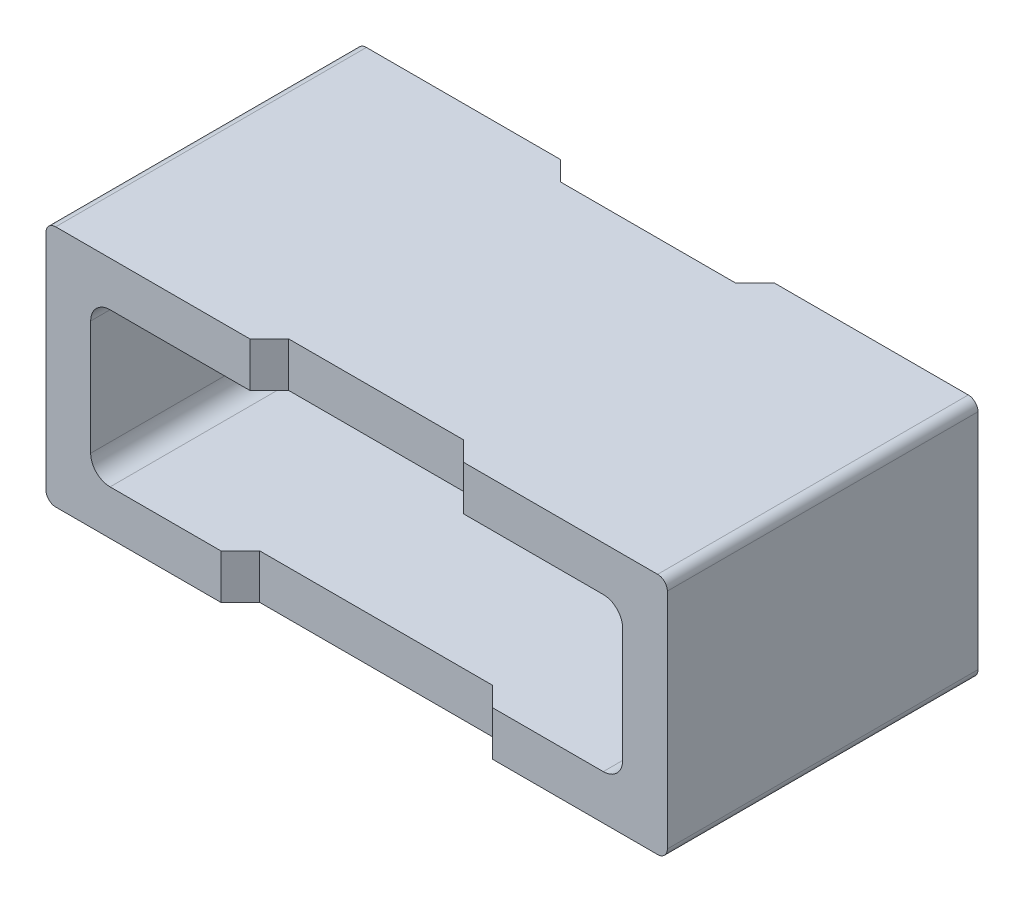
ISO-10303-21;
HEADER;
FILE_DESCRIPTION(('STEP AP214'),'2;1');
FILE_NAME('part.step','',(''),(''),'','','');
FILE_SCHEMA(('AUTOMOTIVE_DESIGN { 1 0 10303 214 1 1 1 1 }'));
ENDSEC;
DATA;
#1=APPLICATION_CONTEXT('core data for automotive mechanical design processes');
#2=APPLICATION_PROTOCOL_DEFINITION('international standard','automotive_design',2000,#1);
#3=PRODUCT_CONTEXT('',#1,'mechanical');
#4=PRODUCT('Part','Part','',(#3));
#5=PRODUCT_RELATED_PRODUCT_CATEGORY('part','',(#4));
#6=PRODUCT_DEFINITION_FORMATION('','',#4);
#7=PRODUCT_DEFINITION_CONTEXT('part definition',#1,'design');
#8=PRODUCT_DEFINITION('design','',#6,#7);
#9=PRODUCT_DEFINITION_SHAPE('','',#8);
#10=(LENGTH_UNIT() NAMED_UNIT(*) SI_UNIT(.MILLI.,.METRE.));
#11=(NAMED_UNIT(*) PLANE_ANGLE_UNIT() SI_UNIT($,.RADIAN.));
#12=(NAMED_UNIT(*) SI_UNIT($,.STERADIAN.) SOLID_ANGLE_UNIT());
#13=UNCERTAINTY_MEASURE_WITH_UNIT(LENGTH_MEASURE(1.E-05),#10,'distance_accuracy_value','');
#14=(GEOMETRIC_REPRESENTATION_CONTEXT(3) GLOBAL_UNCERTAINTY_ASSIGNED_CONTEXT((#13)) GLOBAL_UNIT_ASSIGNED_CONTEXT((#10,
#11,#12)) REPRESENTATION_CONTEXT('',''));
#15=CARTESIAN_POINT('',(0.,0.,0.));
#16=DIRECTION('',(0.,0.,1.));
#17=DIRECTION('',(1.,0.,0.));
#18=AXIS2_PLACEMENT_3D('',#15,#16,#17);
#19=CARTESIAN_POINT('',(-1.27,-0.295,0.));
#20=DIRECTION('',(0.,0.,1.));
#21=DIRECTION('',(1.,0.,0.));
#22=AXIS2_PLACEMENT_3D('',#19,#20,#21);
#23=CYLINDRICAL_SURFACE('',#22,0.1);
#24=CARTESIAN_POINT('',(-1.27,-0.295,-1.6));
#25=DIRECTION('',(0.,0.,1.));
#26=DIRECTION('',(1.,0.,0.));
#27=AXIS2_PLACEMENT_3D('',#24,#25,#26);
#28=CIRCLE('',#27,0.1);
#29=CARTESIAN_POINT('',(-1.37,-0.295,-1.6));
#30=VERTEX_POINT('',#29);
#31=CARTESIAN_POINT('',(-1.27,-0.395,-1.6));
#32=VERTEX_POINT('',#31);
#33=EDGE_CURVE('E230',#30,#32,#28,.T.);
#34=ORIENTED_EDGE('',*,*,#33,.F.);
#35=DIRECTION('',(0.,0.,-1.));
#36=VECTOR('',#35,1.);
#37=CARTESIAN_POINT('',(-1.37,-0.295,0.));
#38=LINE('',#37,#36);
#39=CARTESIAN_POINT('',(-1.37,-0.295,0.));
#40=VERTEX_POINT('',#39);
#41=EDGE_CURVE('E228',#40,#30,#38,.T.);
#42=ORIENTED_EDGE('',*,*,#41,.F.);
#43=CARTESIAN_POINT('',(-1.27,-0.295,0.));
#44=DIRECTION('',(0.,0.,1.));
#45=DIRECTION('',(1.,0.,0.));
#46=AXIS2_PLACEMENT_3D('',#43,#44,#45);
#47=CIRCLE('',#46,0.1);
#48=CARTESIAN_POINT('',(-1.27,-0.395,0.));
#49=VERTEX_POINT('',#48);
#50=EDGE_CURVE('E20',#49,#40,#47,.F.);
#51=ORIENTED_EDGE('',*,*,#50,.F.);
#52=DIRECTION('',(0.,0.,1.));
#53=VECTOR('',#52,1.);
#54=CARTESIAN_POINT('',(-1.27,-0.395,0.));
#55=LINE('',#54,#53);
#56=EDGE_CURVE('E225',#32,#49,#55,.T.);
#57=ORIENTED_EDGE('',*,*,#56,.F.);
#58=EDGE_LOOP('',(#34,#42,#51,#57));
#59=FACE_BOUND('',#58,.T.);
#60=ADVANCED_FACE('F17',(#59),#23,.F.);
#61=CARTESIAN_POINT('',(1.27,-0.295,0.));
#62=DIRECTION('',(0.,0.,1.));
#63=DIRECTION('',(1.,0.,0.));
#64=AXIS2_PLACEMENT_3D('',#61,#62,#63);
#65=CYLINDRICAL_SURFACE('',#64,0.1);
#66=CARTESIAN_POINT('',(1.27,-0.295,-1.6));
#67=DIRECTION('',(0.,0.,1.));
#68=DIRECTION('',(1.,0.,0.));
#69=AXIS2_PLACEMENT_3D('',#66,#67,#68);
#70=CIRCLE('',#69,0.1);
#71=CARTESIAN_POINT('',(1.27,-0.395,-1.6));
#72=VERTEX_POINT('',#71);
#73=CARTESIAN_POINT('',(1.37,-0.295,-1.6));
#74=VERTEX_POINT('',#73);
#75=EDGE_CURVE('E257',#72,#74,#70,.T.);
#76=ORIENTED_EDGE('',*,*,#75,.F.);
#77=DIRECTION('',(0.,0.,1.));
#78=VECTOR('',#77,1.);
#79=CARTESIAN_POINT('',(1.27,-0.395,0.));
#80=LINE('',#79,#78);
#81=CARTESIAN_POINT('',(1.27,-0.395,0.));
#82=VERTEX_POINT('',#81);
#83=EDGE_CURVE('E324',#82,#72,#80,.F.);
#84=ORIENTED_EDGE('',*,*,#83,.F.);
#85=CARTESIAN_POINT('',(1.27,-0.295,0.));
#86=DIRECTION('',(0.,0.,1.));
#87=DIRECTION('',(1.,0.,0.));
#88=AXIS2_PLACEMENT_3D('',#85,#86,#87);
#89=CIRCLE('',#88,0.1);
#90=CARTESIAN_POINT('',(1.37,-0.295,0.));
#91=VERTEX_POINT('',#90);
#92=EDGE_CURVE('E298',#91,#82,#89,.F.);
#93=ORIENTED_EDGE('',*,*,#92,.F.);
#94=DIRECTION('',(0.,0.,1.));
#95=VECTOR('',#94,1.);
#96=CARTESIAN_POINT('',(1.37,-0.295,0.));
#97=LINE('',#96,#95);
#98=EDGE_CURVE('E251',#74,#91,#97,.T.);
#99=ORIENTED_EDGE('',*,*,#98,.F.);
#100=EDGE_LOOP('',(#76,#84,#93,#99));
#101=FACE_BOUND('',#100,.T.);
#102=ADVANCED_FACE('F372',(#101),#65,.F.);
#103=CARTESIAN_POINT('',(-1.37,-0.295,0.));
#104=DIRECTION('',(1.,0.,0.));
#105=DIRECTION('',(0.,0.,-1.));
#106=AXIS2_PLACEMENT_3D('',#103,#104,#105);
#107=PLANE('',#106);
#108=DIRECTION('',(0.,0.,1.));
#109=VECTOR('',#108,1.);
#110=CARTESIAN_POINT('',(-1.37,0.295,0.));
#111=LINE('',#110,#109);
#112=CARTESIAN_POINT('',(-1.37,0.295,-1.6));
#113=VERTEX_POINT('',#112);
#114=CARTESIAN_POINT('',(-1.37,0.295,0.));
#115=VERTEX_POINT('',#114);
#116=EDGE_CURVE('E291',#113,#115,#111,.T.);
#117=ORIENTED_EDGE('',*,*,#116,.T.);
#118=DIRECTION('',(0.,1.,0.));
#119=VECTOR('',#118,1.);
#120=CARTESIAN_POINT('',(-1.37,-0.295,0.));
#121=LINE('',#120,#119);
#122=EDGE_CURVE('E309',#115,#40,#121,.F.);
#123=ORIENTED_EDGE('',*,*,#122,.T.);
#124=ORIENTED_EDGE('',*,*,#41,.T.);
#125=DIRECTION('',(0.,1.,0.));
#126=VECTOR('',#125,1.);
#127=CARTESIAN_POINT('',(-1.37,-0.295,-1.6));
#128=LINE('',#127,#126);
#129=EDGE_CURVE('E256',#30,#113,#128,.T.);
#130=ORIENTED_EDGE('',*,*,#129,.T.);
#131=EDGE_LOOP('',(#117,#123,#124,#130));
#132=FACE_BOUND('',#131,.T.);
#133=ADVANCED_FACE('F311',(#132),#107,.T.);
#134=CARTESIAN_POINT('',(1.37,0.295,0.));
#135=DIRECTION('',(-1.,0.,0.));
#136=DIRECTION('',(0.,0.,1.));
#137=AXIS2_PLACEMENT_3D('',#134,#135,#136);
#138=PLANE('',#137);
#139=ORIENTED_EDGE('',*,*,#98,.T.);
#140=DIRECTION('',(0.,1.,0.));
#141=VECTOR('',#140,1.);
#142=CARTESIAN_POINT('',(1.37,0.295,0.));
#143=LINE('',#142,#141);
#144=CARTESIAN_POINT('',(1.37,0.295,0.));
#145=VERTEX_POINT('',#144);
#146=EDGE_CURVE('E246',#91,#145,#143,.T.);
#147=ORIENTED_EDGE('',*,*,#146,.T.);
#148=DIRECTION('',(0.,0.,1.));
#149=VECTOR('',#148,1.);
#150=CARTESIAN_POINT('',(1.37,0.295,0.));
#151=LINE('',#150,#149);
#152=CARTESIAN_POINT('',(1.37,0.295,-1.6));
#153=VERTEX_POINT('',#152);
#154=EDGE_CURVE('E288',#145,#153,#151,.F.);
#155=ORIENTED_EDGE('',*,*,#154,.T.);
#156=DIRECTION('',(0.,1.,0.));
#157=VECTOR('',#156,1.);
#158=CARTESIAN_POINT('',(1.37,0.295,-1.6));
#159=LINE('',#158,#157);
#160=EDGE_CURVE('E254',#153,#74,#159,.F.);
#161=ORIENTED_EDGE('',*,*,#160,.T.);
#162=EDGE_LOOP('',(#139,#147,#155,#161));
#163=FACE_BOUND('',#162,.T.);
#164=ADVANCED_FACE('F355',(#163),#138,.T.);
#165=CARTESIAN_POINT('',(1.27,-0.395,0.));
#166=DIRECTION('',(0.,1.,0.));
#167=DIRECTION('',(0.,0.,1.));
#168=AXIS2_PLACEMENT_3D('',#165,#166,#167);
#169=PLANE('',#168);
#170=DIRECTION('',(1.,0.,0.));
#171=VECTOR('',#170,1.);
#172=CARTESIAN_POINT('',(0.6,-0.395,-1.5));
#173=LINE('',#172,#171);
#174=CARTESIAN_POINT('',(0.6,-0.395,-1.5));
#175=VERTEX_POINT('',#174);
#176=CARTESIAN_POINT('',(-0.6,-0.395,-1.5));
#177=VERTEX_POINT('',#176);
#178=EDGE_CURVE('E285',#175,#177,#173,.F.);
#179=ORIENTED_EDGE('',*,*,#178,.T.);
#180=DIRECTION('',(-0.707106781186547,0.,-0.707106781186548));
#181=VECTOR('',#180,1.);
#182=CARTESIAN_POINT('',(-0.6,-0.395,-1.5));
#183=LINE('',#182,#181);
#184=CARTESIAN_POINT('',(-0.7,-0.395,-1.6));
#185=VERTEX_POINT('',#184);
#186=EDGE_CURVE('E296',#177,#185,#183,.T.);
#187=ORIENTED_EDGE('',*,*,#186,.T.);
#188=DIRECTION('',(1.,0.,0.));
#189=VECTOR('',#188,1.);
#190=CARTESIAN_POINT('',(1.27,-0.395,-1.6));
#191=LINE('',#190,#189);
#192=EDGE_CURVE('E244',#185,#32,#191,.F.);
#193=ORIENTED_EDGE('',*,*,#192,.T.);
#194=ORIENTED_EDGE('',*,*,#56,.T.);
#195=DIRECTION('',(1.,0.,0.));
#196=VECTOR('',#195,1.);
#197=CARTESIAN_POINT('',(1.27,-0.395,0.));
#198=LINE('',#197,#196);
#199=CARTESIAN_POINT('',(-0.7,-0.395,0.));
#200=VERTEX_POINT('',#199);
#201=EDGE_CURVE('E233',#49,#200,#198,.T.);
#202=ORIENTED_EDGE('',*,*,#201,.T.);
#203=DIRECTION('',(0.707106781186547,0.,-0.707106781186548));
#204=VECTOR('',#203,1.);
#205=CARTESIAN_POINT('',(-0.7,-0.395,0.));
#206=LINE('',#205,#204);
#207=CARTESIAN_POINT('',(-0.6,-0.395,-0.1));
#208=VERTEX_POINT('',#207);
#209=EDGE_CURVE('E239',#200,#208,#206,.T.);
#210=ORIENTED_EDGE('',*,*,#209,.T.);
#211=DIRECTION('',(-1.,0.,0.));
#212=VECTOR('',#211,1.);
#213=CARTESIAN_POINT('',(-0.6,-0.395,-0.1));
#214=LINE('',#213,#212);
#215=CARTESIAN_POINT('',(0.6,-0.395,-0.1));
#216=VERTEX_POINT('',#215);
#217=EDGE_CURVE('E278',#208,#216,#214,.F.);
#218=ORIENTED_EDGE('',*,*,#217,.T.);
#219=DIRECTION('',(0.707106781186548,0.,0.707106781186547));
#220=VECTOR('',#219,1.);
#221=CARTESIAN_POINT('',(0.6,-0.395,-0.1));
#222=LINE('',#221,#220);
#223=CARTESIAN_POINT('',(0.7,-0.395,0.));
#224=VERTEX_POINT('',#223);
#225=EDGE_CURVE('E332',#216,#224,#222,.T.);
#226=ORIENTED_EDGE('',*,*,#225,.T.);
#227=DIRECTION('',(1.,0.,0.));
#228=VECTOR('',#227,1.);
#229=CARTESIAN_POINT('',(1.27,-0.395,0.));
#230=LINE('',#229,#228);
#231=EDGE_CURVE('E329',#224,#82,#230,.T.);
#232=ORIENTED_EDGE('',*,*,#231,.T.);
#233=ORIENTED_EDGE('',*,*,#83,.T.);
#234=DIRECTION('',(1.,0.,0.));
#235=VECTOR('',#234,1.);
#236=CARTESIAN_POINT('',(1.27,-0.395,-1.6));
#237=LINE('',#236,#235);
#238=CARTESIAN_POINT('',(0.7,-0.395,-1.6));
#239=VERTEX_POINT('',#238);
#240=EDGE_CURVE('E320',#72,#239,#237,.F.);
#241=ORIENTED_EDGE('',*,*,#240,.T.);
#242=DIRECTION('',(-0.707106781186548,0.,0.707106781186548));
#243=VECTOR('',#242,1.);
#244=CARTESIAN_POINT('',(0.7,-0.395,-1.6));
#245=LINE('',#244,#243);
#246=EDGE_CURVE('E323',#239,#175,#245,.T.);
#247=ORIENTED_EDGE('',*,*,#246,.T.);
#248=EDGE_LOOP('',(#179,#187,#193,#194,#202,#210,#218,#226,#232,#233,#241,#247));
#249=FACE_BOUND('',#248,.T.);
#250=ADVANCED_FACE('F242',(#249),#169,.T.);
#251=CARTESIAN_POINT('',(-1.27,0.295,0.));
#252=DIRECTION('',(0.,0.,1.));
#253=DIRECTION('',(1.,0.,0.));
#254=AXIS2_PLACEMENT_3D('',#251,#252,#253);
#255=CYLINDRICAL_SURFACE('',#254,0.1);
#256=CARTESIAN_POINT('',(-1.27,0.295,-1.6));
#257=DIRECTION('',(0.,0.,1.));
#258=DIRECTION('',(1.,0.,0.));
#259=AXIS2_PLACEMENT_3D('',#256,#257,#258);
#260=CIRCLE('',#259,0.1);
#261=CARTESIAN_POINT('',(-1.27,0.395,-1.6));
#262=VERTEX_POINT('',#261);
#263=EDGE_CURVE('E292',#262,#113,#260,.T.);
#264=ORIENTED_EDGE('',*,*,#263,.F.);
#265=DIRECTION('',(0.,0.,-1.));
#266=VECTOR('',#265,1.);
#267=CARTESIAN_POINT('',(-1.27,0.395,0.));
#268=LINE('',#267,#266);
#269=CARTESIAN_POINT('',(-1.27,0.395,0.));
#270=VERTEX_POINT('',#269);
#271=EDGE_CURVE('E444',#270,#262,#268,.T.);
#272=ORIENTED_EDGE('',*,*,#271,.F.);
#273=CARTESIAN_POINT('',(-1.27,0.295,0.));
#274=DIRECTION('',(0.,0.,1.));
#275=DIRECTION('',(1.,0.,0.));
#276=AXIS2_PLACEMENT_3D('',#273,#274,#275);
#277=CIRCLE('',#276,0.1);
#278=EDGE_CURVE('E294',#115,#270,#277,.F.);
#279=ORIENTED_EDGE('',*,*,#278,.F.);
#280=ORIENTED_EDGE('',*,*,#116,.F.);
#281=EDGE_LOOP('',(#264,#272,#279,#280));
#282=FACE_BOUND('',#281,.T.);
#283=ADVANCED_FACE('F459',(#282),#255,.F.);
#284=CARTESIAN_POINT('',(1.27,0.295,0.));
#285=DIRECTION('',(0.,0.,1.));
#286=DIRECTION('',(1.,0.,0.));
#287=AXIS2_PLACEMENT_3D('',#284,#285,#286);
#288=CYLINDRICAL_SURFACE('',#287,0.1);
#289=CARTESIAN_POINT('',(1.27,0.295,-1.6));
#290=DIRECTION('',(0.,0.,1.));
#291=DIRECTION('',(1.,0.,0.));
#292=AXIS2_PLACEMENT_3D('',#289,#290,#291);
#293=CIRCLE('',#292,0.1);
#294=CARTESIAN_POINT('',(1.27,0.395,-1.6));
#295=VERTEX_POINT('',#294);
#296=EDGE_CURVE('E286',#153,#295,#293,.T.);
#297=ORIENTED_EDGE('',*,*,#296,.F.);
#298=ORIENTED_EDGE('',*,*,#154,.F.);
#299=CARTESIAN_POINT('',(1.27,0.295,0.));
#300=DIRECTION('',(0.,0.,1.));
#301=DIRECTION('',(1.,0.,0.));
#302=AXIS2_PLACEMENT_3D('',#299,#300,#301);
#303=CIRCLE('',#302,0.1);
#304=CARTESIAN_POINT('',(1.27,0.395,0.));
#305=VERTEX_POINT('',#304);
#306=EDGE_CURVE('E289',#305,#145,#303,.F.);
#307=ORIENTED_EDGE('',*,*,#306,.F.);
#308=DIRECTION('',(0.,0.,-1.));
#309=VECTOR('',#308,1.);
#310=CARTESIAN_POINT('',(1.27,0.395,0.));
#311=LINE('',#310,#309);
#312=EDGE_CURVE('E363',#295,#305,#311,.F.);
#313=ORIENTED_EDGE('',*,*,#312,.F.);
#314=EDGE_LOOP('',(#297,#298,#307,#313));
#315=FACE_BOUND('',#314,.T.);
#316=ADVANCED_FACE('F360',(#315),#288,.F.);
#317=CARTESIAN_POINT('',(0.6,-0.625,-1.5));
#318=DIRECTION('',(0.,0.,1.));
#319=DIRECTION('',(1.,0.,0.));
#320=AXIS2_PLACEMENT_3D('',#317,#318,#319);
#321=PLANE('',#320);
#322=DIRECTION('',(0.,1.,0.));
#323=VECTOR('',#322,1.);
#324=CARTESIAN_POINT('',(0.6,-0.625,-1.5));
#325=LINE('',#324,#323);
#326=CARTESIAN_POINT('',(0.6,-0.625,-1.5));
#327=VERTEX_POINT('',#326);
#328=EDGE_CURVE('E431',#175,#327,#325,.F.);
#329=ORIENTED_EDGE('',*,*,#328,.T.);
#330=DIRECTION('',(1.,0.,0.));
#331=VECTOR('',#330,1.);
#332=CARTESIAN_POINT('',(-1.55,-0.625,-1.5));
#333=LINE('',#332,#331);
#334=CARTESIAN_POINT('',(-0.6,-0.625,-1.5));
#335=VERTEX_POINT('',#334);
#336=EDGE_CURVE('E423',#335,#327,#333,.T.);
#337=ORIENTED_EDGE('',*,*,#336,.F.);
#338=DIRECTION('',(0.,1.,0.));
#339=VECTOR('',#338,1.);
#340=CARTESIAN_POINT('',(-0.6,-0.625,-1.5));
#341=LINE('',#340,#339);
#342=EDGE_CURVE('E399',#335,#177,#341,.T.);
#343=ORIENTED_EDGE('',*,*,#342,.T.);
#344=ORIENTED_EDGE('',*,*,#178,.F.);
#345=EDGE_LOOP('',(#329,#337,#343,#344));
#346=FACE_BOUND('',#345,.T.);
#347=ADVANCED_FACE('F706',(#346),#321,.F.);
#348=CARTESIAN_POINT('',(1.55,-0.575,0.));
#349=DIRECTION('',(0.,0.,1.));
#350=DIRECTION('',(1.,0.,0.));
#351=AXIS2_PLACEMENT_3D('',#348,#349,#350);
#352=CYLINDRICAL_SURFACE('',#351,0.05);
#353=DIRECTION('',(0.,0.,-1.));
#354=VECTOR('',#353,1.);
#355=CARTESIAN_POINT('',(1.6,-0.575,0.));
#356=LINE('',#355,#354);
#357=CARTESIAN_POINT('',(1.6,-0.575,0.));
#358=VERTEX_POINT('',#357);
#359=CARTESIAN_POINT('',(1.6,-0.575,-1.6));
#360=VERTEX_POINT('',#359);
#361=EDGE_CURVE('E435',#358,#360,#356,.T.);
#362=ORIENTED_EDGE('',*,*,#361,.F.);
#363=CARTESIAN_POINT('',(1.55,-0.575,0.));
#364=DIRECTION('',(0.,0.,1.));
#365=DIRECTION('',(1.,0.,0.));
#366=AXIS2_PLACEMENT_3D('',#363,#364,#365);
#367=CIRCLE('',#366,0.05);
#368=CARTESIAN_POINT('',(1.55,-0.625,0.));
#369=VERTEX_POINT('',#368);
#370=EDGE_CURVE('E281',#358,#369,#367,.F.);
#371=ORIENTED_EDGE('',*,*,#370,.T.);
#372=DIRECTION('',(0.,0.,-1.));
#373=VECTOR('',#372,1.);
#374=CARTESIAN_POINT('',(1.55,-0.625,0.));
#375=LINE('',#374,#373);
#376=CARTESIAN_POINT('',(1.55,-0.625,-1.6));
#377=VERTEX_POINT('',#376);
#378=EDGE_CURVE('E595',#377,#369,#375,.F.);
#379=ORIENTED_EDGE('',*,*,#378,.F.);
#380=CARTESIAN_POINT('',(1.55,-0.575,-1.6));
#381=DIRECTION('',(0.,0.,1.));
#382=DIRECTION('',(1.,0.,0.));
#383=AXIS2_PLACEMENT_3D('',#380,#381,#382);
#384=CIRCLE('',#383,0.05);
#385=EDGE_CURVE('E283',#377,#360,#384,.T.);
#386=ORIENTED_EDGE('',*,*,#385,.T.);
#387=EDGE_LOOP('',(#362,#371,#379,#386));
#388=FACE_BOUND('',#387,.T.);
#389=ADVANCED_FACE('F616',(#388),#352,.T.);
#390=CARTESIAN_POINT('',(-1.55,-0.575,0.));
#391=DIRECTION('',(0.,0.,1.));
#392=DIRECTION('',(1.,0.,0.));
#393=AXIS2_PLACEMENT_3D('',#390,#391,#392);
#394=CYLINDRICAL_SURFACE('',#393,0.05);
#395=DIRECTION('',(0.,0.,-1.));
#396=VECTOR('',#395,1.);
#397=CARTESIAN_POINT('',(-1.55,-0.625,0.));
#398=LINE('',#397,#396);
#399=CARTESIAN_POINT('',(-1.55,-0.625,0.));
#400=VERTEX_POINT('',#399);
#401=CARTESIAN_POINT('',(-1.55,-0.625,-1.6));
#402=VERTEX_POINT('',#401);
#403=EDGE_CURVE('E405',#400,#402,#398,.T.);
#404=ORIENTED_EDGE('',*,*,#403,.F.);
#405=CARTESIAN_POINT('',(-1.55,-0.575,0.));
#406=DIRECTION('',(0.,0.,1.));
#407=DIRECTION('',(1.,0.,0.));
#408=AXIS2_PLACEMENT_3D('',#405,#406,#407);
#409=CIRCLE('',#408,0.05);
#410=CARTESIAN_POINT('',(-1.6,-0.575,0.));
#411=VERTEX_POINT('',#410);
#412=EDGE_CURVE('E276',#400,#411,#409,.F.);
#413=ORIENTED_EDGE('',*,*,#412,.T.);
#414=DIRECTION('',(0.,0.,1.));
#415=VECTOR('',#414,1.);
#416=CARTESIAN_POINT('',(-1.6,-0.575,0.));
#417=LINE('',#416,#415);
#418=CARTESIAN_POINT('',(-1.6,-0.575,-1.6));
#419=VERTEX_POINT('',#418);
#420=EDGE_CURVE('E420',#419,#411,#417,.T.);
#421=ORIENTED_EDGE('',*,*,#420,.F.);
#422=CARTESIAN_POINT('',(-1.55,-0.575,-1.6));
#423=DIRECTION('',(0.,0.,1.));
#424=DIRECTION('',(1.,0.,0.));
#425=AXIS2_PLACEMENT_3D('',#422,#423,#424);
#426=CIRCLE('',#425,0.05);
#427=EDGE_CURVE('E279',#419,#402,#426,.T.);
#428=ORIENTED_EDGE('',*,*,#427,.T.);
#429=EDGE_LOOP('',(#404,#413,#421,#428));
#430=FACE_BOUND('',#429,.T.);
#431=ADVANCED_FACE('F724',(#430),#394,.T.);
#432=CARTESIAN_POINT('',(-0.6,-0.625,-0.1));
#433=DIRECTION('',(0.,0.,-1.));
#434=DIRECTION('',(-1.,0.,0.));
#435=AXIS2_PLACEMENT_3D('',#432,#433,#434);
#436=PLANE('',#435);
#437=DIRECTION('',(0.,1.,0.));
#438=VECTOR('',#437,1.);
#439=CARTESIAN_POINT('',(0.6,-0.625,-0.1));
#440=LINE('',#439,#438);
#441=CARTESIAN_POINT('',(0.6,-0.625,-0.1));
#442=VERTEX_POINT('',#441);
#443=EDGE_CURVE('E415',#442,#216,#440,.T.);
#444=ORIENTED_EDGE('',*,*,#443,.T.);
#445=ORIENTED_EDGE('',*,*,#217,.F.);
#446=DIRECTION('',(0.,1.,0.));
#447=VECTOR('',#446,1.);
#448=CARTESIAN_POINT('',(-0.6,-0.625,-0.1));
#449=LINE('',#448,#447);
#450=CARTESIAN_POINT('',(-0.6,-0.625,-0.1));
#451=VERTEX_POINT('',#450);
#452=EDGE_CURVE('E408',#208,#451,#449,.F.);
#453=ORIENTED_EDGE('',*,*,#452,.T.);
#454=DIRECTION('',(1.,0.,0.));
#455=VECTOR('',#454,1.);
#456=CARTESIAN_POINT('',(-1.55,-0.625,-0.1));
#457=LINE('',#456,#455);
#458=EDGE_CURVE('E402',#442,#451,#457,.F.);
#459=ORIENTED_EDGE('',*,*,#458,.F.);
#460=EDGE_LOOP('',(#444,#445,#453,#459));
#461=FACE_BOUND('',#460,.T.);
#462=ADVANCED_FACE('F718',(#461),#436,.F.);
#463=CARTESIAN_POINT('',(0.6,-0.625,-0.1));
#464=DIRECTION('',(0.707106781186548,0.,-0.707106781186548));
#465=DIRECTION('',(-0.707106781186548,0.,-0.707106781186548));
#466=AXIS2_PLACEMENT_3D('',#463,#464,#465);
#467=PLANE('',#466);
#468=DIRECTION('',(0.,1.,0.));
#469=VECTOR('',#468,1.);
#470=CARTESIAN_POINT('',(0.7,0.,0.));
#471=LINE('',#470,#469);
#472=CARTESIAN_POINT('',(0.7,-0.625,0.));
#473=VERTEX_POINT('',#472);
#474=EDGE_CURVE('E377',#224,#473,#471,.F.);
#475=ORIENTED_EDGE('',*,*,#474,.F.);
#476=ORIENTED_EDGE('',*,*,#225,.F.);
#477=ORIENTED_EDGE('',*,*,#443,.F.);
#478=DIRECTION('',(-0.707106781186548,0.,-0.707106781186547));
#479=VECTOR('',#478,1.);
#480=CARTESIAN_POINT('',(0.7,-0.625,0.));
#481=LINE('',#480,#479);
#482=EDGE_CURVE('E381',#473,#442,#481,.T.);
#483=ORIENTED_EDGE('',*,*,#482,.F.);
#484=EDGE_LOOP('',(#475,#476,#477,#483));
#485=FACE_BOUND('',#484,.T.);
#486=ADVANCED_FACE('F379',(#485),#467,.F.);
#487=CARTESIAN_POINT('',(0.7,-0.625,-1.6));
#488=DIRECTION('',(0.707106781186548,0.,0.707106781186548));
#489=DIRECTION('',(0.707106781186548,0.,-0.707106781186548));
#490=AXIS2_PLACEMENT_3D('',#487,#488,#489);
#491=PLANE('',#490);
#492=DIRECTION('',(0.,1.,0.));
#493=VECTOR('',#492,1.);
#494=CARTESIAN_POINT('',(0.7,0.,-1.6));
#495=LINE('',#494,#493);
#496=CARTESIAN_POINT('',(0.7,-0.625,-1.6));
#497=VERTEX_POINT('',#496);
#498=EDGE_CURVE('E274',#239,#497,#495,.F.);
#499=ORIENTED_EDGE('',*,*,#498,.T.);
#500=DIRECTION('',(0.707106781186548,0.,-0.707106781186547));
#501=VECTOR('',#500,1.);
#502=CARTESIAN_POINT('',(0.6,-0.625,-1.5));
#503=LINE('',#502,#501);
#504=EDGE_CURVE('E426',#327,#497,#503,.T.);
#505=ORIENTED_EDGE('',*,*,#504,.F.);
#506=ORIENTED_EDGE('',*,*,#328,.F.);
#507=ORIENTED_EDGE('',*,*,#246,.F.);
#508=EDGE_LOOP('',(#499,#505,#506,#507));
#509=FACE_BOUND('',#508,.T.);
#510=ADVANCED_FACE('F710',(#509),#491,.F.);
#511=CARTESIAN_POINT('',(1.6,-0.575,0.));
#512=DIRECTION('',(1.,0.,0.));
#513=DIRECTION('',(0.,0.,-1.));
#514=AXIS2_PLACEMENT_3D('',#511,#512,#513);
#515=PLANE('',#514);
#516=DIRECTION('',(0.,0.,1.));
#517=VECTOR('',#516,1.);
#518=CARTESIAN_POINT('',(1.6,0.575,0.));
#519=LINE('',#518,#517);
#520=CARTESIAN_POINT('',(1.6,0.575,0.));
#521=VERTEX_POINT('',#520);
#522=CARTESIAN_POINT('',(1.6,0.575,-1.6));
#523=VERTEX_POINT('',#522);
#524=EDGE_CURVE('E275',#521,#523,#519,.F.);
#525=ORIENTED_EDGE('',*,*,#524,.F.);
#526=DIRECTION('',(0.,1.,0.));
#527=VECTOR('',#526,1.);
#528=CARTESIAN_POINT('',(1.6,0.,0.));
#529=LINE('',#528,#527);
#530=EDGE_CURVE('E531',#358,#521,#529,.T.);
#531=ORIENTED_EDGE('',*,*,#530,.F.);
#532=ORIENTED_EDGE('',*,*,#361,.T.);
#533=DIRECTION('',(0.,1.,0.));
#534=VECTOR('',#533,1.);
#535=CARTESIAN_POINT('',(1.6,0.,-1.6));
#536=LINE('',#535,#534);
#537=EDGE_CURVE('E270',#360,#523,#536,.T.);
#538=ORIENTED_EDGE('',*,*,#537,.T.);
#539=EDGE_LOOP('',(#525,#531,#532,#538));
#540=FACE_BOUND('',#539,.T.);
#541=ADVANCED_FACE('F619',(#540),#515,.T.);
#542=CARTESIAN_POINT('',(-1.27,0.395,0.));
#543=DIRECTION('',(0.,-1.,0.));
#544=DIRECTION('',(0.,0.,-1.));
#545=AXIS2_PLACEMENT_3D('',#542,#543,#544);
#546=PLANE('',#545);
#547=DIRECTION('',(-1.,0.,0.));
#548=VECTOR('',#547,1.);
#549=CARTESIAN_POINT('',(0.45,0.395,-0.1));
#550=LINE('',#549,#548);
#551=CARTESIAN_POINT('',(0.45,0.395,-0.1));
#552=VERTEX_POINT('',#551);
#553=CARTESIAN_POINT('',(-0.45,0.395,-0.1));
#554=VERTEX_POINT('',#553);
#555=EDGE_CURVE('E561',#552,#554,#550,.T.);
#556=ORIENTED_EDGE('',*,*,#555,.T.);
#557=DIRECTION('',(-0.707106781186547,0.,0.707106781186548));
#558=VECTOR('',#557,1.);
#559=CARTESIAN_POINT('',(-0.45,0.395,-0.1));
#560=LINE('',#559,#558);
#561=CARTESIAN_POINT('',(-0.55,0.395,0.));
#562=VERTEX_POINT('',#561);
#563=EDGE_CURVE('E396',#554,#562,#560,.T.);
#564=ORIENTED_EDGE('',*,*,#563,.T.);
#565=DIRECTION('',(1.,0.,0.));
#566=VECTOR('',#565,1.);
#567=CARTESIAN_POINT('',(-1.27,0.395,0.));
#568=LINE('',#567,#566);
#569=EDGE_CURVE('E441',#562,#270,#568,.F.);
#570=ORIENTED_EDGE('',*,*,#569,.T.);
#571=ORIENTED_EDGE('',*,*,#271,.T.);
#572=DIRECTION('',(1.,0.,0.));
#573=VECTOR('',#572,1.);
#574=CARTESIAN_POINT('',(-1.27,0.395,-1.6));
#575=LINE('',#574,#573);
#576=CARTESIAN_POINT('',(-0.55,0.395,-1.6));
#577=VERTEX_POINT('',#576);
#578=EDGE_CURVE('E447',#262,#577,#575,.T.);
#579=ORIENTED_EDGE('',*,*,#578,.T.);
#580=DIRECTION('',(0.707106781186547,0.,0.707106781186548));
#581=VECTOR('',#580,1.);
#582=CARTESIAN_POINT('',(-0.55,0.395,-1.6));
#583=LINE('',#582,#581);
#584=CARTESIAN_POINT('',(-0.45,0.395,-1.5));
#585=VERTEX_POINT('',#584);
#586=EDGE_CURVE('E450',#577,#585,#583,.T.);
#587=ORIENTED_EDGE('',*,*,#586,.T.);
#588=DIRECTION('',(1.,0.,0.));
#589=VECTOR('',#588,1.);
#590=CARTESIAN_POINT('',(-0.45,0.395,-1.5));
#591=LINE('',#590,#589);
#592=CARTESIAN_POINT('',(0.45,0.395,-1.5));
#593=VERTEX_POINT('',#592);
#594=EDGE_CURVE('E494',#585,#593,#591,.T.);
#595=ORIENTED_EDGE('',*,*,#594,.T.);
#596=DIRECTION('',(0.707106781186548,0.,-0.707106781186548));
#597=VECTOR('',#596,1.);
#598=CARTESIAN_POINT('',(0.45,0.395,-1.5));
#599=LINE('',#598,#597);
#600=CARTESIAN_POINT('',(0.55,0.395,-1.6));
#601=VERTEX_POINT('',#600);
#602=EDGE_CURVE('E504',#593,#601,#599,.T.);
#603=ORIENTED_EDGE('',*,*,#602,.T.);
#604=DIRECTION('',(1.,0.,0.));
#605=VECTOR('',#604,1.);
#606=CARTESIAN_POINT('',(0.,0.395,-1.6));
#607=LINE('',#606,#605);
#608=EDGE_CURVE('E269',#601,#295,#607,.T.);
#609=ORIENTED_EDGE('',*,*,#608,.T.);
#610=ORIENTED_EDGE('',*,*,#312,.T.);
#611=DIRECTION('',(1.,0.,0.));
#612=VECTOR('',#611,1.);
#613=CARTESIAN_POINT('',(0.,0.395,0.));
#614=LINE('',#613,#612);
#615=CARTESIAN_POINT('',(0.55,0.395,0.));
#616=VERTEX_POINT('',#615);
#617=EDGE_CURVE('E383',#616,#305,#614,.T.);
#618=ORIENTED_EDGE('',*,*,#617,.F.);
#619=DIRECTION('',(-0.707106781186548,0.,-0.707106781186548));
#620=VECTOR('',#619,1.);
#621=CARTESIAN_POINT('',(0.55,0.395,0.));
#622=LINE('',#621,#620);
#623=EDGE_CURVE('E549',#616,#552,#622,.T.);
#624=ORIENTED_EDGE('',*,*,#623,.T.);
#625=EDGE_LOOP('',(#556,#564,#570,#571,#579,#587,#595,#603,#609,#610,#618,#624));
#626=FACE_BOUND('',#625,.T.);
#627=ADVANCED_FACE('F457',(#626),#546,.T.);
#628=CARTESIAN_POINT('',(-0.6,-0.625,-1.5));
#629=DIRECTION('',(-0.707106781186548,0.,0.707106781186548));
#630=DIRECTION('',(0.707106781186548,0.,0.707106781186548));
#631=AXIS2_PLACEMENT_3D('',#628,#629,#630);
#632=PLANE('',#631);
#633=DIRECTION('',(0.,1.,0.));
#634=VECTOR('',#633,1.);
#635=CARTESIAN_POINT('',(-0.7,0.,-1.6));
#636=LINE('',#635,#634);
#637=CARTESIAN_POINT('',(-0.7,-0.625,-1.6));
#638=VERTEX_POINT('',#637);
#639=EDGE_CURVE('E469',#638,#185,#636,.T.);
#640=ORIENTED_EDGE('',*,*,#639,.T.);
#641=ORIENTED_EDGE('',*,*,#186,.F.);
#642=ORIENTED_EDGE('',*,*,#342,.F.);
#643=DIRECTION('',(0.707106781186548,0.,0.707106781186548));
#644=VECTOR('',#643,1.);
#645=CARTESIAN_POINT('',(-0.7,-0.625,-1.6));
#646=LINE('',#645,#644);
#647=EDGE_CURVE('E411',#638,#335,#646,.T.);
#648=ORIENTED_EDGE('',*,*,#647,.F.);
#649=EDGE_LOOP('',(#640,#641,#642,#648));
#650=FACE_BOUND('',#649,.T.);
#651=ADVANCED_FACE('F701',(#650),#632,.F.);
#652=CARTESIAN_POINT('',(-1.6,0.575,0.));
#653=DIRECTION('',(-1.,0.,0.));
#654=DIRECTION('',(0.,0.,1.));
#655=AXIS2_PLACEMENT_3D('',#652,#653,#654);
#656=PLANE('',#655);
#657=ORIENTED_EDGE('',*,*,#420,.T.);
#658=DIRECTION('',(0.,1.,0.));
#659=VECTOR('',#658,1.);
#660=CARTESIAN_POINT('',(-1.6,0.,0.));
#661=LINE('',#660,#659);
#662=CARTESIAN_POINT('',(-1.6,0.575,0.));
#663=VERTEX_POINT('',#662);
#664=EDGE_CURVE('E261',#663,#411,#661,.F.);
#665=ORIENTED_EDGE('',*,*,#664,.F.);
#666=DIRECTION('',(0.,0.,1.));
#667=VECTOR('',#666,1.);
#668=CARTESIAN_POINT('',(-1.6,0.575,0.));
#669=LINE('',#668,#667);
#670=CARTESIAN_POINT('',(-1.6,0.575,-1.6));
#671=VERTEX_POINT('',#670);
#672=EDGE_CURVE('E262',#671,#663,#669,.T.);
#673=ORIENTED_EDGE('',*,*,#672,.F.);
#674=DIRECTION('',(0.,1.,0.));
#675=VECTOR('',#674,1.);
#676=CARTESIAN_POINT('',(-1.6,0.,-1.6));
#677=LINE('',#676,#675);
#678=EDGE_CURVE('E468',#671,#419,#677,.F.);
#679=ORIENTED_EDGE('',*,*,#678,.T.);
#680=EDGE_LOOP('',(#657,#665,#673,#679));
#681=FACE_BOUND('',#680,.T.);
#682=ADVANCED_FACE('F677',(#681),#656,.T.);
#683=CARTESIAN_POINT('',(-1.55,-0.625,0.));
#684=DIRECTION('',(0.,-1.,0.));
#685=DIRECTION('',(0.,0.,-1.));
#686=AXIS2_PLACEMENT_3D('',#683,#684,#685);
#687=PLANE('',#686);
#688=DIRECTION('',(1.,0.,0.));
#689=VECTOR('',#688,1.);
#690=CARTESIAN_POINT('',(0.,-0.625,-1.6));
#691=LINE('',#690,#689);
#692=EDGE_CURVE('E266',#402,#638,#691,.T.);
#693=ORIENTED_EDGE('',*,*,#692,.T.);
#694=ORIENTED_EDGE('',*,*,#647,.T.);
#695=ORIENTED_EDGE('',*,*,#336,.T.);
#696=ORIENTED_EDGE('',*,*,#504,.T.);
#697=DIRECTION('',(1.,0.,0.));
#698=VECTOR('',#697,1.);
#699=CARTESIAN_POINT('',(0.,-0.625,-1.6));
#700=LINE('',#699,#698);
#701=EDGE_CURVE('E516',#497,#377,#700,.T.);
#702=ORIENTED_EDGE('',*,*,#701,.T.);
#703=ORIENTED_EDGE('',*,*,#378,.T.);
#704=DIRECTION('',(1.,0.,0.));
#705=VECTOR('',#704,1.);
#706=CARTESIAN_POINT('',(0.,-0.625,0.));
#707=LINE('',#706,#705);
#708=EDGE_CURVE('E534',#473,#369,#707,.T.);
#709=ORIENTED_EDGE('',*,*,#708,.F.);
#710=ORIENTED_EDGE('',*,*,#482,.T.);
#711=ORIENTED_EDGE('',*,*,#458,.T.);
#712=DIRECTION('',(-0.707106781186548,0.,0.707106781186548));
#713=VECTOR('',#712,1.);
#714=CARTESIAN_POINT('',(-0.7,-0.625,0.));
#715=LINE('',#714,#713);
#716=CARTESIAN_POINT('',(-0.7,-0.625,0.));
#717=VERTEX_POINT('',#716);
#718=EDGE_CURVE('E410',#451,#717,#715,.T.);
#719=ORIENTED_EDGE('',*,*,#718,.T.);
#720=DIRECTION('',(1.,0.,0.));
#721=VECTOR('',#720,1.);
#722=CARTESIAN_POINT('',(0.,-0.625,0.));
#723=LINE('',#722,#721);
#724=EDGE_CURVE('E568',#400,#717,#723,.T.);
#725=ORIENTED_EDGE('',*,*,#724,.F.);
#726=ORIENTED_EDGE('',*,*,#403,.T.);
#727=EDGE_LOOP('',(#693,#694,#695,#696,#702,#703,#709,#710,#711,#719,#725,#726));
#728=FACE_BOUND('',#727,.T.);
#729=ADVANCED_FACE('F609',(#728),#687,.T.);
#730=CARTESIAN_POINT('',(-0.7,-0.625,0.));
#731=DIRECTION('',(-0.707106781186548,0.,-0.707106781186548));
#732=DIRECTION('',(-0.707106781186548,0.,0.707106781186548));
#733=AXIS2_PLACEMENT_3D('',#730,#731,#732);
#734=PLANE('',#733);
#735=DIRECTION('',(0.,1.,0.));
#736=VECTOR('',#735,1.);
#737=CARTESIAN_POINT('',(-0.7,0.,0.));
#738=LINE('',#737,#736);
#739=EDGE_CURVE('E237',#717,#200,#738,.T.);
#740=ORIENTED_EDGE('',*,*,#739,.F.);
#741=ORIENTED_EDGE('',*,*,#718,.F.);
#742=ORIENTED_EDGE('',*,*,#452,.F.);
#743=ORIENTED_EDGE('',*,*,#209,.F.);
#744=EDGE_LOOP('',(#740,#741,#742,#743));
#745=FACE_BOUND('',#744,.T.);
#746=ADVANCED_FACE('F859',(#745),#734,.F.);
#747=CARTESIAN_POINT('',(0.45,0.625,-0.1));
#748=DIRECTION('',(0.,0.,-1.));
#749=DIRECTION('',(-1.,0.,0.));
#750=AXIS2_PLACEMENT_3D('',#747,#748,#749);
#751=PLANE('',#750);
#752=ORIENTED_EDGE('',*,*,#555,.F.);
#753=DIRECTION('',(0.,1.,0.));
#754=VECTOR('',#753,1.);
#755=CARTESIAN_POINT('',(0.45,0.625,-0.1));
#756=LINE('',#755,#754);
#757=CARTESIAN_POINT('',(0.45,0.625,-0.1));
#758=VERTEX_POINT('',#757);
#759=EDGE_CURVE('E536',#552,#758,#756,.T.);
#760=ORIENTED_EDGE('',*,*,#759,.T.);
#761=DIRECTION('',(1.,0.,0.));
#762=VECTOR('',#761,1.);
#763=CARTESIAN_POINT('',(1.55,0.625,-0.1));
#764=LINE('',#763,#762);
#765=CARTESIAN_POINT('',(-0.45,0.625,-0.1));
#766=VERTEX_POINT('',#765);
#767=EDGE_CURVE('E545',#766,#758,#764,.T.);
#768=ORIENTED_EDGE('',*,*,#767,.F.);
#769=DIRECTION('',(0.,1.,0.));
#770=VECTOR('',#769,1.);
#771=CARTESIAN_POINT('',(-0.45,0.625,-0.1));
#772=LINE('',#771,#770);
#773=EDGE_CURVE('E554',#766,#554,#772,.F.);
#774=ORIENTED_EDGE('',*,*,#773,.T.);
#775=EDGE_LOOP('',(#752,#760,#768,#774));
#776=FACE_BOUND('',#775,.T.);
#777=ADVANCED_FACE('F868',(#776),#751,.F.);
#778=CARTESIAN_POINT('',(0.55,0.625,0.));
#779=DIRECTION('',(0.707106781186548,0.,-0.707106781186548));
#780=DIRECTION('',(-0.707106781186548,0.,-0.707106781186548));
#781=AXIS2_PLACEMENT_3D('',#778,#779,#780);
#782=PLANE('',#781);
#783=ORIENTED_EDGE('',*,*,#759,.F.);
#784=ORIENTED_EDGE('',*,*,#623,.F.);
#785=DIRECTION('',(0.,1.,0.));
#786=VECTOR('',#785,1.);
#787=CARTESIAN_POINT('',(0.55,0.,0.));
#788=LINE('',#787,#786);
#789=CARTESIAN_POINT('',(0.55,0.625,0.));
#790=VERTEX_POINT('',#789);
#791=EDGE_CURVE('E388',#790,#616,#788,.F.);
#792=ORIENTED_EDGE('',*,*,#791,.F.);
#793=DIRECTION('',(0.707106781186548,0.,0.707106781186547));
#794=VECTOR('',#793,1.);
#795=CARTESIAN_POINT('',(0.45,0.625,-0.1));
#796=LINE('',#795,#794);
#797=EDGE_CURVE('E526',#758,#790,#796,.T.);
#798=ORIENTED_EDGE('',*,*,#797,.F.);
#799=EDGE_LOOP('',(#783,#784,#792,#798));
#800=FACE_BOUND('',#799,.T.);
#801=ADVANCED_FACE('F635',(#800),#782,.F.);
#802=CARTESIAN_POINT('',(0.,0.,0.));
#803=DIRECTION('',(0.,0.,1.));
#804=DIRECTION('',(1.,0.,0.));
#805=AXIS2_PLACEMENT_3D('',#802,#803,#804);
#806=PLANE('',#805);
#807=ORIENTED_EDGE('',*,*,#231,.F.);
#808=ORIENTED_EDGE('',*,*,#474,.T.);
#809=ORIENTED_EDGE('',*,*,#708,.T.);
#810=ORIENTED_EDGE('',*,*,#370,.F.);
#811=ORIENTED_EDGE('',*,*,#530,.T.);
#812=CARTESIAN_POINT('',(1.55,0.575,0.));
#813=DIRECTION('',(0.,0.,1.));
#814=DIRECTION('',(1.,0.,0.));
#815=AXIS2_PLACEMENT_3D('',#812,#813,#814);
#816=CIRCLE('',#815,0.05);
#817=CARTESIAN_POINT('',(1.55,0.625,0.));
#818=VERTEX_POINT('',#817);
#819=EDGE_CURVE('E271',#818,#521,#816,.F.);
#820=ORIENTED_EDGE('',*,*,#819,.F.);
#821=DIRECTION('',(1.,0.,0.));
#822=VECTOR('',#821,1.);
#823=CARTESIAN_POINT('',(1.55,0.625,0.));
#824=LINE('',#823,#822);
#825=EDGE_CURVE('E523',#790,#818,#824,.T.);
#826=ORIENTED_EDGE('',*,*,#825,.F.);
#827=ORIENTED_EDGE('',*,*,#791,.T.);
#828=ORIENTED_EDGE('',*,*,#617,.T.);
#829=ORIENTED_EDGE('',*,*,#306,.T.);
#830=ORIENTED_EDGE('',*,*,#146,.F.);
#831=ORIENTED_EDGE('',*,*,#92,.T.);
#832=EDGE_LOOP('',(#807,#808,#809,#810,#811,#820,#826,#827,#828,#829,#830,#831));
#833=FACE_BOUND('',#832,.T.);
#834=ADVANCED_FACE('F373',(#833),#806,.T.);
#835=CARTESIAN_POINT('',(1.55,0.575,0.));
#836=DIRECTION('',(0.,0.,1.));
#837=DIRECTION('',(1.,0.,0.));
#838=AXIS2_PLACEMENT_3D('',#835,#836,#837);
#839=CYLINDRICAL_SURFACE('',#838,0.05);
#840=DIRECTION('',(0.,0.,1.));
#841=VECTOR('',#840,1.);
#842=CARTESIAN_POINT('',(1.55,0.625,0.));
#843=LINE('',#842,#841);
#844=CARTESIAN_POINT('',(1.55,0.625,-1.6));
#845=VERTEX_POINT('',#844);
#846=EDGE_CURVE('E509',#818,#845,#843,.F.);
#847=ORIENTED_EDGE('',*,*,#846,.F.);
#848=ORIENTED_EDGE('',*,*,#819,.T.);
#849=ORIENTED_EDGE('',*,*,#524,.T.);
#850=CARTESIAN_POINT('',(1.55,0.575,-1.6));
#851=DIRECTION('',(0.,0.,1.));
#852=DIRECTION('',(1.,0.,0.));
#853=AXIS2_PLACEMENT_3D('',#850,#851,#852);
#854=CIRCLE('',#853,0.05);
#855=EDGE_CURVE('E267',#523,#845,#854,.T.);
#856=ORIENTED_EDGE('',*,*,#855,.T.);
#857=EDGE_LOOP('',(#847,#848,#849,#856));
#858=FACE_BOUND('',#857,.T.);
#859=ADVANCED_FACE('F623',(#858),#839,.T.);
#860=CARTESIAN_POINT('',(0.,0.,-1.6));
#861=DIRECTION('',(0.,0.,1.));
#862=DIRECTION('',(1.,0.,0.));
#863=AXIS2_PLACEMENT_3D('',#860,#861,#862);
#864=PLANE('',#863);
#865=ORIENTED_EDGE('',*,*,#75,.T.);
#866=ORIENTED_EDGE('',*,*,#160,.F.);
#867=ORIENTED_EDGE('',*,*,#296,.T.);
#868=ORIENTED_EDGE('',*,*,#608,.F.);
#869=DIRECTION('',(0.,1.,0.));
#870=VECTOR('',#869,1.);
#871=CARTESIAN_POINT('',(0.55,0.625,-1.6));
#872=LINE('',#871,#870);
#873=CARTESIAN_POINT('',(0.55,0.625,-1.6));
#874=VERTEX_POINT('',#873);
#875=EDGE_CURVE('E502',#601,#874,#872,.T.);
#876=ORIENTED_EDGE('',*,*,#875,.T.);
#877=DIRECTION('',(1.,0.,0.));
#878=VECTOR('',#877,1.);
#879=CARTESIAN_POINT('',(1.55,0.625,-1.6));
#880=LINE('',#879,#878);
#881=EDGE_CURVE('E499',#845,#874,#880,.F.);
#882=ORIENTED_EDGE('',*,*,#881,.F.);
#883=ORIENTED_EDGE('',*,*,#855,.F.);
#884=ORIENTED_EDGE('',*,*,#537,.F.);
#885=ORIENTED_EDGE('',*,*,#385,.F.);
#886=ORIENTED_EDGE('',*,*,#701,.F.);
#887=ORIENTED_EDGE('',*,*,#498,.F.);
#888=ORIENTED_EDGE('',*,*,#240,.F.);
#889=EDGE_LOOP('',(#865,#866,#867,#868,#876,#882,#883,#884,#885,#886,#887,#888));
#890=FACE_BOUND('',#889,.T.);
#891=ADVANCED_FACE('F366',(#890),#864,.F.);
#892=CARTESIAN_POINT('',(0.45,0.625,-1.5));
#893=DIRECTION('',(0.707106781186548,0.,0.707106781186548));
#894=DIRECTION('',(0.707106781186548,0.,-0.707106781186548));
#895=AXIS2_PLACEMENT_3D('',#892,#893,#894);
#896=PLANE('',#895);
#897=DIRECTION('',(0.,1.,0.));
#898=VECTOR('',#897,1.);
#899=CARTESIAN_POINT('',(0.45,0.625,-1.5));
#900=LINE('',#899,#898);
#901=CARTESIAN_POINT('',(0.45,0.625,-1.5));
#902=VERTEX_POINT('',#901);
#903=EDGE_CURVE('E485',#593,#902,#900,.T.);
#904=ORIENTED_EDGE('',*,*,#903,.T.);
#905=DIRECTION('',(-0.707106781186548,0.,0.707106781186548));
#906=VECTOR('',#905,1.);
#907=CARTESIAN_POINT('',(0.55,0.625,-1.6));
#908=LINE('',#907,#906);
#909=EDGE_CURVE('E490',#874,#902,#908,.T.);
#910=ORIENTED_EDGE('',*,*,#909,.F.);
#911=ORIENTED_EDGE('',*,*,#875,.F.);
#912=ORIENTED_EDGE('',*,*,#602,.F.);
#913=EDGE_LOOP('',(#904,#910,#911,#912));
#914=FACE_BOUND('',#913,.T.);
#915=ADVANCED_FACE('F641',(#914),#896,.F.);
#916=CARTESIAN_POINT('',(-0.45,0.625,-1.5));
#917=DIRECTION('',(0.,0.,1.));
#918=DIRECTION('',(1.,0.,0.));
#919=AXIS2_PLACEMENT_3D('',#916,#917,#918);
#920=PLANE('',#919);
#921=ORIENTED_EDGE('',*,*,#594,.F.);
#922=DIRECTION('',(0.,1.,0.));
#923=VECTOR('',#922,1.);
#924=CARTESIAN_POINT('',(-0.45,0.625,-1.5));
#925=LINE('',#924,#923);
#926=CARTESIAN_POINT('',(-0.45,0.625,-1.5));
#927=VERTEX_POINT('',#926);
#928=EDGE_CURVE('E473',#585,#927,#925,.T.);
#929=ORIENTED_EDGE('',*,*,#928,.T.);
#930=DIRECTION('',(1.,0.,0.));
#931=VECTOR('',#930,1.);
#932=CARTESIAN_POINT('',(1.55,0.625,-1.5));
#933=LINE('',#932,#931);
#934=EDGE_CURVE('E481',#902,#927,#933,.F.);
#935=ORIENTED_EDGE('',*,*,#934,.F.);
#936=ORIENTED_EDGE('',*,*,#903,.F.);
#937=EDGE_LOOP('',(#921,#929,#935,#936));
#938=FACE_BOUND('',#937,.T.);
#939=ADVANCED_FACE('F644',(#938),#920,.F.);
#940=CARTESIAN_POINT('',(-0.55,0.625,-1.6));
#941=DIRECTION('',(-0.707106781186548,0.,0.707106781186548));
#942=DIRECTION('',(0.707106781186548,0.,0.707106781186548));
#943=AXIS2_PLACEMENT_3D('',#940,#941,#942);
#944=PLANE('',#943);
#945=ORIENTED_EDGE('',*,*,#928,.F.);
#946=ORIENTED_EDGE('',*,*,#586,.F.);
#947=DIRECTION('',(0.,1.,0.));
#948=VECTOR('',#947,1.);
#949=CARTESIAN_POINT('',(-0.55,0.,-1.6));
#950=LINE('',#949,#948);
#951=CARTESIAN_POINT('',(-0.55,0.625,-1.6));
#952=VERTEX_POINT('',#951);
#953=EDGE_CURVE('E462',#577,#952,#950,.T.);
#954=ORIENTED_EDGE('',*,*,#953,.T.);
#955=DIRECTION('',(-0.707106781186548,0.,-0.707106781186547));
#956=VECTOR('',#955,1.);
#957=CARTESIAN_POINT('',(-0.45,0.625,-1.5));
#958=LINE('',#957,#956);
#959=EDGE_CURVE('E479',#927,#952,#958,.T.);
#960=ORIENTED_EDGE('',*,*,#959,.F.);
#961=EDGE_LOOP('',(#945,#946,#954,#960));
#962=FACE_BOUND('',#961,.T.);
#963=ADVANCED_FACE('F646',(#962),#944,.F.);
#964=CARTESIAN_POINT('',(0.,0.,-1.6));
#965=DIRECTION('',(0.,0.,1.));
#966=DIRECTION('',(1.,0.,0.));
#967=AXIS2_PLACEMENT_3D('',#964,#965,#966);
#968=PLANE('',#967);
#969=ORIENTED_EDGE('',*,*,#427,.F.);
#970=ORIENTED_EDGE('',*,*,#678,.F.);
#971=CARTESIAN_POINT('',(-1.55,0.575,-1.6));
#972=DIRECTION('',(0.,0.,1.));
#973=DIRECTION('',(1.,0.,0.));
#974=AXIS2_PLACEMENT_3D('',#971,#972,#973);
#975=CIRCLE('',#974,0.05);
#976=CARTESIAN_POINT('',(-1.55,0.625,-1.6));
#977=VERTEX_POINT('',#976);
#978=EDGE_CURVE('E263',#977,#671,#975,.T.);
#979=ORIENTED_EDGE('',*,*,#978,.F.);
#980=DIRECTION('',(1.,0.,0.));
#981=VECTOR('',#980,1.);
#982=CARTESIAN_POINT('',(1.55,0.625,-1.6));
#983=LINE('',#982,#981);
#984=EDGE_CURVE('E464',#952,#977,#983,.F.);
#985=ORIENTED_EDGE('',*,*,#984,.F.);
#986=ORIENTED_EDGE('',*,*,#953,.F.);
#987=ORIENTED_EDGE('',*,*,#578,.F.);
#988=ORIENTED_EDGE('',*,*,#263,.T.);
#989=ORIENTED_EDGE('',*,*,#129,.F.);
#990=ORIENTED_EDGE('',*,*,#33,.T.);
#991=ORIENTED_EDGE('',*,*,#192,.F.);
#992=ORIENTED_EDGE('',*,*,#639,.F.);
#993=ORIENTED_EDGE('',*,*,#692,.F.);
#994=EDGE_LOOP('',(#969,#970,#979,#985,#986,#987,#988,#989,#990,#991,#992,#993));
#995=FACE_BOUND('',#994,.T.);
#996=ADVANCED_FACE('F301',(#995),#968,.F.);
#997=CARTESIAN_POINT('',(-1.55,0.575,0.));
#998=DIRECTION('',(0.,0.,1.));
#999=DIRECTION('',(1.,0.,0.));
#1000=AXIS2_PLACEMENT_3D('',#997,#998,#999);
#1001=CYLINDRICAL_SURFACE('',#1000,0.05);
#1002=ORIENTED_EDGE('',*,*,#672,.T.);
#1003=CARTESIAN_POINT('',(-1.55,0.575,0.));
#1004=DIRECTION('',(0.,0.,1.));
#1005=DIRECTION('',(1.,0.,0.));
#1006=AXIS2_PLACEMENT_3D('',#1003,#1004,#1005);
#1007=CIRCLE('',#1006,0.05);
#1008=CARTESIAN_POINT('',(-1.55,0.625,0.));
#1009=VERTEX_POINT('',#1008);
#1010=EDGE_CURVE('E258',#1009,#663,#1007,.T.);
#1011=ORIENTED_EDGE('',*,*,#1010,.F.);
#1012=DIRECTION('',(0.,0.,1.));
#1013=VECTOR('',#1012,1.);
#1014=CARTESIAN_POINT('',(-1.55,0.625,0.));
#1015=LINE('',#1014,#1013);
#1016=EDGE_CURVE('E681',#977,#1009,#1015,.T.);
#1017=ORIENTED_EDGE('',*,*,#1016,.F.);
#1018=ORIENTED_EDGE('',*,*,#978,.T.);
#1019=EDGE_LOOP('',(#1002,#1011,#1017,#1018));
#1020=FACE_BOUND('',#1019,.T.);
#1021=ADVANCED_FACE('F654',(#1020),#1001,.T.);
#1022=CARTESIAN_POINT('',(0.,0.,0.));
#1023=DIRECTION('',(0.,0.,1.));
#1024=DIRECTION('',(1.,0.,0.));
#1025=AXIS2_PLACEMENT_3D('',#1022,#1023,#1024);
#1026=PLANE('',#1025);
#1027=ORIENTED_EDGE('',*,*,#724,.T.);
#1028=ORIENTED_EDGE('',*,*,#739,.T.);
#1029=ORIENTED_EDGE('',*,*,#201,.F.);
#1030=ORIENTED_EDGE('',*,*,#50,.T.);
#1031=ORIENTED_EDGE('',*,*,#122,.F.);
#1032=ORIENTED_EDGE('',*,*,#278,.T.);
#1033=ORIENTED_EDGE('',*,*,#569,.F.);
#1034=DIRECTION('',(0.,1.,0.));
#1035=VECTOR('',#1034,1.);
#1036=CARTESIAN_POINT('',(-0.55,0.625,0.));
#1037=LINE('',#1036,#1035);
#1038=CARTESIAN_POINT('',(-0.55,0.625,0.));
#1039=VERTEX_POINT('',#1038);
#1040=EDGE_CURVE('E35',#562,#1039,#1037,.T.);
#1041=ORIENTED_EDGE('',*,*,#1040,.T.);
#1042=DIRECTION('',(1.,0.,0.));
#1043=VECTOR('',#1042,1.);
#1044=CARTESIAN_POINT('',(1.55,0.625,0.));
#1045=LINE('',#1044,#1043);
#1046=EDGE_CURVE('E26',#1009,#1039,#1045,.T.);
#1047=ORIENTED_EDGE('',*,*,#1046,.F.);
#1048=ORIENTED_EDGE('',*,*,#1010,.T.);
#1049=ORIENTED_EDGE('',*,*,#664,.T.);
#1050=ORIENTED_EDGE('',*,*,#412,.F.);
#1051=EDGE_LOOP('',(#1027,#1028,#1029,#1030,#1031,#1032,#1033,#1041,#1047,#1048,#1049,#1050));
#1052=FACE_BOUND('',#1051,.T.);
#1053=ADVANCED_FACE('F235',(#1052),#1026,.T.);
#1054=CARTESIAN_POINT('',(-0.45,0.625,-0.1));
#1055=DIRECTION('',(-0.707106781186548,0.,-0.707106781186548));
#1056=DIRECTION('',(-0.707106781186548,0.,0.707106781186548));
#1057=AXIS2_PLACEMENT_3D('',#1054,#1055,#1056);
#1058=PLANE('',#1057);
#1059=ORIENTED_EDGE('',*,*,#773,.F.);
#1060=DIRECTION('',(0.707106781186548,0.,-0.707106781186547));
#1061=VECTOR('',#1060,1.);
#1062=CARTESIAN_POINT('',(-0.55,0.625,0.));
#1063=LINE('',#1062,#1061);
#1064=EDGE_CURVE('E11',#1039,#766,#1063,.T.);
#1065=ORIENTED_EDGE('',*,*,#1064,.F.);
#1066=ORIENTED_EDGE('',*,*,#1040,.F.);
#1067=ORIENTED_EDGE('',*,*,#563,.F.);
#1068=EDGE_LOOP('',(#1059,#1065,#1066,#1067));
#1069=FACE_BOUND('',#1068,.T.);
#1070=ADVANCED_FACE('F658',(#1069),#1058,.F.);
#1071=CARTESIAN_POINT('',(1.55,0.625,0.));
#1072=DIRECTION('',(0.,1.,0.));
#1073=DIRECTION('',(0.,0.,1.));
#1074=AXIS2_PLACEMENT_3D('',#1071,#1072,#1073);
#1075=PLANE('',#1074);
#1076=ORIENTED_EDGE('',*,*,#1046,.T.);
#1077=ORIENTED_EDGE('',*,*,#1064,.T.);
#1078=ORIENTED_EDGE('',*,*,#767,.T.);
#1079=ORIENTED_EDGE('',*,*,#797,.T.);
#1080=ORIENTED_EDGE('',*,*,#825,.T.);
#1081=ORIENTED_EDGE('',*,*,#846,.T.);
#1082=ORIENTED_EDGE('',*,*,#881,.T.);
#1083=ORIENTED_EDGE('',*,*,#909,.T.);
#1084=ORIENTED_EDGE('',*,*,#934,.T.);
#1085=ORIENTED_EDGE('',*,*,#959,.T.);
#1086=ORIENTED_EDGE('',*,*,#984,.T.);
#1087=ORIENTED_EDGE('',*,*,#1016,.T.);
#1088=EDGE_LOOP('',(#1076,#1077,#1078,#1079,#1080,#1081,#1082,#1083,#1084,#1085,#1086,#1087));
#1089=FACE_BOUND('',#1088,.T.);
#1090=ADVANCED_FACE('F629',(#1089),#1075,.T.);
#1091=CLOSED_SHELL('',(#60,#102,#133,#164,#250,#283,#316,#347,#389,#431,#462,#486,#510,#541,
#627,#651,#682,#729,#746,#777,#801,#834,#859,#891,#915,#939,#963,#996,#1021,#1053,#1070,#1090));
#1092=MANIFOLD_SOLID_BREP('B1',#1091);
#1093=ADVANCED_BREP_SHAPE_REPRESENTATION('',(#18,#1092),#14);
#1094=SHAPE_DEFINITION_REPRESENTATION(#9,#1093);
ENDSEC;
END-ISO-10303-21;
